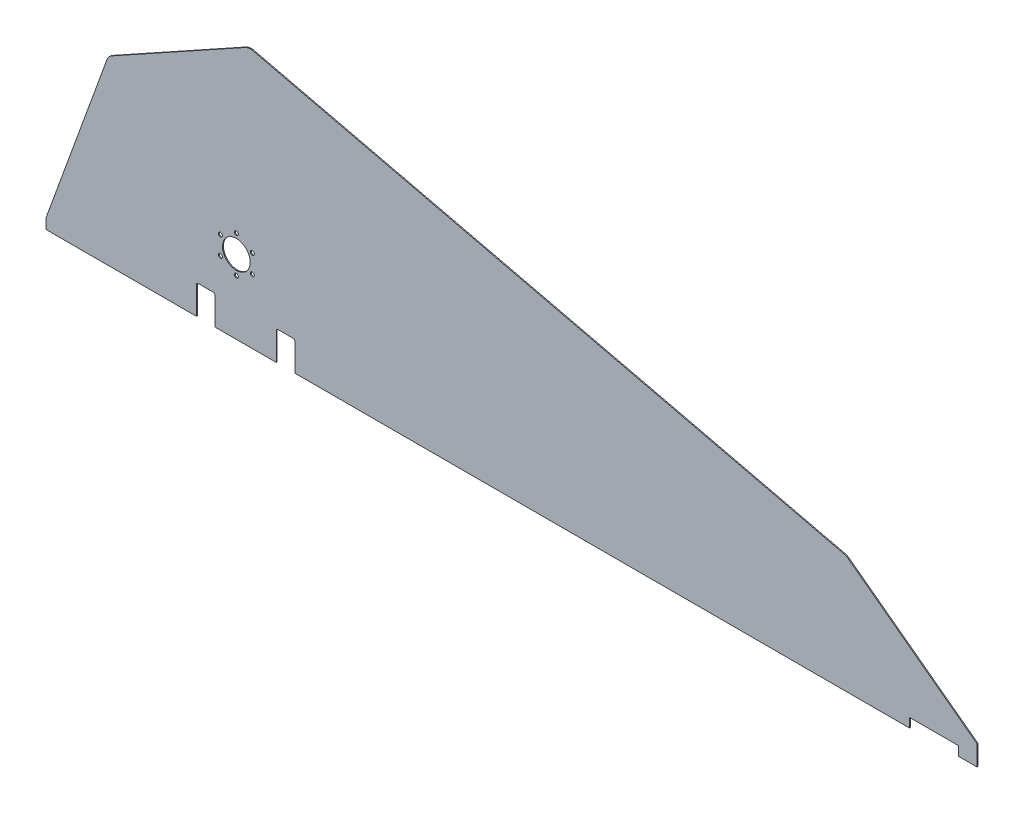
ISO-10303-21;
HEADER;
FILE_DESCRIPTION(('STEP AP214'),'2;1');
FILE_NAME('part.step','',(''),(''),'','','');
FILE_SCHEMA(('AUTOMOTIVE_DESIGN { 1 0 10303 214 1 1 1 1 }'));
ENDSEC;
DATA;
#1=APPLICATION_CONTEXT('core data for automotive mechanical design processes');
#2=APPLICATION_PROTOCOL_DEFINITION('international standard','automotive_design',2000,#1);
#3=PRODUCT_CONTEXT('',#1,'mechanical');
#4=PRODUCT('Part','Part','',(#3));
#5=PRODUCT_RELATED_PRODUCT_CATEGORY('part','',(#4));
#6=PRODUCT_DEFINITION_FORMATION('','',#4);
#7=PRODUCT_DEFINITION_CONTEXT('part definition',#1,'design');
#8=PRODUCT_DEFINITION('design','',#6,#7);
#9=PRODUCT_DEFINITION_SHAPE('','',#8);
#10=(LENGTH_UNIT() NAMED_UNIT(*) SI_UNIT(.MILLI.,.METRE.));
#11=(NAMED_UNIT(*) PLANE_ANGLE_UNIT() SI_UNIT($,.RADIAN.));
#12=(NAMED_UNIT(*) SI_UNIT($,.STERADIAN.) SOLID_ANGLE_UNIT());
#13=UNCERTAINTY_MEASURE_WITH_UNIT(LENGTH_MEASURE(1.E-05),#10,'distance_accuracy_value','');
#14=(GEOMETRIC_REPRESENTATION_CONTEXT(3) GLOBAL_UNCERTAINTY_ASSIGNED_CONTEXT((#13)) GLOBAL_UNIT_ASSIGNED_CONTEXT((#10,
#11,#12)) REPRESENTATION_CONTEXT('',''));
#15=CARTESIAN_POINT('',(0.,0.,0.));
#16=DIRECTION('',(0.,0.,1.));
#17=DIRECTION('',(1.,0.,0.));
#18=AXIS2_PLACEMENT_3D('',#15,#16,#17);
#19=CARTESIAN_POINT('',(-325.733197448333,28.2261893195208,1.5));
#20=DIRECTION('',(0.,0.,1.));
#21=DIRECTION('',(1.,0.,0.));
#22=AXIS2_PLACEMENT_3D('',#19,#20,#21);
#23=PLANE('',#22);
#24=CARTESIAN_POINT('',(-443.713959561865,88.2261893195209,1.5));
#25=DIRECTION('',(0.,0.,1.));
#26=DIRECTION('',(1.,0.,0.));
#27=AXIS2_PLACEMENT_3D('',#24,#25,#26);
#28=CIRCLE('',#27,3.24999999999998);
#29=CARTESIAN_POINT('',(-440.463959561865,88.2261893195209,1.5));
#30=VERTEX_POINT('',#29);
#31=EDGE_CURVE('E493',#30,#30,#28,.T.);
#32=ORIENTED_EDGE('',*,*,#31,.F.);
#33=EDGE_LOOP('',(#32));
#34=FACE_BOUND('',#33,.T.);
#35=CARTESIAN_POINT('',(-391.752435334798,88.2261893195219,1.5));
#36=DIRECTION('',(0.,0.,1.));
#37=DIRECTION('',(1.,0.,0.));
#38=AXIS2_PLACEMENT_3D('',#35,#36,#37);
#39=CIRCLE('',#38,3.24999999999991);
#40=CARTESIAN_POINT('',(-388.502435334798,88.2261893195219,1.5));
#41=VERTEX_POINT('',#40);
#42=EDGE_CURVE('E505',#41,#41,#39,.T.);
#43=ORIENTED_EDGE('',*,*,#42,.F.);
#44=EDGE_LOOP('',(#43));
#45=FACE_BOUND('',#44,.T.);
#46=CARTESIAN_POINT('',(-417.733197448333,103.226189319521,1.5));
#47=DIRECTION('',(0.,0.,1.));
#48=DIRECTION('',(1.,0.,0.));
#49=AXIS2_PLACEMENT_3D('',#46,#47,#48);
#50=CIRCLE('',#49,22.5000000000001);
#51=CARTESIAN_POINT('',(-395.233197448333,103.226189319521,1.5));
#52=VERTEX_POINT('',#51);
#53=EDGE_CURVE('E517',#52,#52,#50,.T.);
#54=ORIENTED_EDGE('',*,*,#53,.F.);
#55=EDGE_LOOP('',(#54));
#56=FACE_BOUND('',#55,.T.);
#57=DIRECTION('',(1.,0.,0.));
#58=VECTOR('',#57,1.);
#59=CARTESIAN_POINT('',(757.266802551668,-1.50000000000028,1.5));
#60=LINE('',#59,#58);
#61=CARTESIAN_POINT('',(677.266802551668,-1.50000000000028,1.5));
#62=VERTEX_POINT('',#61);
#63=CARTESIAN_POINT('',(757.266802551668,-1.50000000000028,1.5));
#64=VERTEX_POINT('',#63);
#65=EDGE_CURVE('E297',#62,#64,#60,.T.);
#66=ORIENTED_EDGE('',*,*,#65,.T.);
#67=DIRECTION('',(0.,-1.,0.));
#68=VECTOR('',#67,1.);
#69=CARTESIAN_POINT('',(757.266802551668,-16.5000000000003,1.5));
#70=LINE('',#69,#68);
#71=CARTESIAN_POINT('',(757.266802551668,-16.5000000000003,1.5));
#72=VERTEX_POINT('',#71);
#73=EDGE_CURVE('E150',#64,#72,#70,.T.);
#74=ORIENTED_EDGE('',*,*,#73,.T.);
#75=DIRECTION('',(1.,0.,0.));
#76=VECTOR('',#75,1.);
#77=CARTESIAN_POINT('',(787.266802551668,-16.5000000000001,1.5));
#78=LINE('',#77,#76);
#79=CARTESIAN_POINT('',(787.266802551668,-16.5000000000001,1.5));
#80=VERTEX_POINT('',#79);
#81=EDGE_CURVE('E366',#72,#80,#78,.T.);
#82=ORIENTED_EDGE('',*,*,#81,.T.);
#83=DIRECTION('',(0.,1.,0.));
#84=VECTOR('',#83,1.);
#85=CARTESIAN_POINT('',(787.266802551668,16.1155859339347,1.5));
#86=LINE('',#85,#84);
#87=CARTESIAN_POINT('',(787.266802551668,16.1155859339347,1.5));
#88=VERTEX_POINT('',#87);
#89=EDGE_CURVE('E384',#80,#88,#86,.T.);
#90=ORIENTED_EDGE('',*,*,#89,.T.);
#91=DIRECTION('',(-0.80191170374577,0.597442565771437,0.));
#92=VECTOR('',#91,1.);
#93=CARTESIAN_POINT('',(643.325554365466,123.355108982436,1.5));
#94=LINE('',#93,#92);
#95=CARTESIAN_POINT('',(577.338388413991,172.517057299047,1.5));
#96=VERTEX_POINT('',#95);
#97=EDGE_CURVE('E381',#88,#96,#94,.T.);
#98=ORIENTED_EDGE('',*,*,#97,.T.);
#99=CARTESIAN_POINT('',(567.038478580091,158.69209952647,1.5));
#100=DIRECTION('',(0.,0.,1.));
#101=DIRECTION('',(1.,0.,0.));
#102=AXIS2_PLACEMENT_3D('',#99,#100,#101);
#103=CIRCLE('',#102,17.2400000000004);
#104=CARTESIAN_POINT('',(571.017994955942,175.46651604134,1.5));
#105=VERTEX_POINT('',#104);
#106=EDGE_CURVE('E383',#96,#105,#103,.T.);
#107=ORIENTED_EDGE('',*,*,#106,.T.);
#108=DIRECTION('',(-0.972993997382236,0.230830416232648,0.));
#109=VECTOR('',#108,1.);
#110=CARTESIAN_POINT('',(-390.951446304286,403.681496942147,1.5));
#111=LINE('',#110,#109);
#112=CARTESIAN_POINT('',(-390.951446304286,403.681496942147,1.5));
#113=VERTEX_POINT('',#112);
#114=EDGE_CURVE('E386',#105,#113,#111,.T.);
#115=ORIENTED_EDGE('',*,*,#114,.T.);
#116=CARTESIAN_POINT('',(-394.930962680136,386.907080427276,1.5));
#117=DIRECTION('',(0.,0.,1.));
#118=DIRECTION('',(1.,0.,0.));
#119=AXIS2_PLACEMENT_3D('',#116,#117,#118);
#120=CIRCLE('',#119,17.2400000000002);
#121=CARTESIAN_POINT('',(-403.291964068148,401.983925448357,1.5));
#122=VERTEX_POINT('',#121);
#123=EDGE_CURVE('E392',#113,#122,#120,.T.);
#124=ORIENTED_EDGE('',*,*,#123,.T.);
#125=DIRECTION('',(-0.874526973380525,-0.48497687865495,0.));
#126=VECTOR('',#125,1.);
#127=CARTESIAN_POINT('',(-620.432527225473,281.566653305973,1.5));
#128=LINE('',#127,#126);
#129=CARTESIAN_POINT('',(-620.432527225473,281.566653305973,1.5));
#130=VERTEX_POINT('',#129);
#131=EDGE_CURVE('E394',#122,#130,#128,.T.);
#132=ORIENTED_EDGE('',*,*,#131,.T.);
#133=CARTESIAN_POINT('',(-612.071525837462,266.489808284892,1.5));
#134=DIRECTION('',(0.,0.,1.));
#135=DIRECTION('',(1.,0.,0.));
#136=AXIS2_PLACEMENT_3D('',#133,#134,#135);
#137=CIRCLE('',#136,17.2400000000002);
#138=CARTESIAN_POINT('',(-628.271826619812,272.386235555827,1.5));
#139=VERTEX_POINT('',#138);
#140=EDGE_CURVE('E396',#130,#139,#137,.T.);
#141=ORIENTED_EDGE('',*,*,#140,.T.);
#142=DIRECTION('',(-0.342020143325663,-0.93969262078591,0.));
#143=VECTOR('',#142,1.);
#144=CARTESIAN_POINT('',(-665.607683437264,169.806812013883,1.5));
#145=LINE('',#144,#143);
#146=CARTESIAN_POINT('',(-727.412308585953,0.,1.5));
#147=VERTEX_POINT('',#146);
#148=EDGE_CURVE('E398',#139,#147,#145,.T.);
#149=ORIENTED_EDGE('',*,*,#148,.T.);
#150=DIRECTION('',(0.,-1.,0.));
#151=VECTOR('',#150,1.);
#152=CARTESIAN_POINT('',(-727.412308585953,0.,1.5));
#153=LINE('',#152,#151);
#154=CARTESIAN_POINT('',(-727.412308585953,-16.5000000000001,1.5));
#155=VERTEX_POINT('',#154);
#156=EDGE_CURVE('E400',#147,#155,#153,.T.);
#157=ORIENTED_EDGE('',*,*,#156,.T.);
#158=DIRECTION('',(1.,0.,0.));
#159=VECTOR('',#158,1.);
#160=CARTESIAN_POINT('',(-727.412308585953,-16.5000000000001,1.5));
#161=LINE('',#160,#159);
#162=CARTESIAN_POINT('',(-482.733197448333,-16.5000000000001,1.5));
#163=VERTEX_POINT('',#162);
#164=EDGE_CURVE('E402',#155,#163,#161,.T.);
#165=ORIENTED_EDGE('',*,*,#164,.T.);
#166=DIRECTION('',(0.,1.,0.));
#167=VECTOR('',#166,1.);
#168=CARTESIAN_POINT('',(-482.733197448333,4.22618931952079,1.5));
#169=LINE('',#168,#167);
#170=CARTESIAN_POINT('',(-482.733197448333,28.2261893195208,1.5));
#171=VERTEX_POINT('',#170);
#172=EDGE_CURVE('E404',#163,#171,#169,.T.);
#173=ORIENTED_EDGE('',*,*,#172,.T.);
#174=CARTESIAN_POINT('',(-479.733197448332,28.2261893195208,1.5));
#175=DIRECTION('',(0.,0.,-1.));
#176=DIRECTION('',(1.,0.,0.));
#177=AXIS2_PLACEMENT_3D('',#174,#175,#176);
#178=CIRCLE('',#177,3.);
#179=CARTESIAN_POINT('',(-479.733197448332,31.2261893195208,1.5));
#180=VERTEX_POINT('',#179);
#181=EDGE_CURVE('E406',#171,#180,#178,.T.);
#182=ORIENTED_EDGE('',*,*,#181,.T.);
#183=DIRECTION('',(1.,0.,0.));
#184=VECTOR('',#183,1.);
#185=CARTESIAN_POINT('',(-455.733197448332,31.2261893195208,1.5));
#186=LINE('',#185,#184);
#187=CARTESIAN_POINT('',(-455.733197448332,31.2261893195208,1.5));
#188=VERTEX_POINT('',#187);
#189=EDGE_CURVE('E408',#180,#188,#186,.T.);
#190=ORIENTED_EDGE('',*,*,#189,.T.);
#191=CARTESIAN_POINT('',(-455.733197448332,28.2261893195208,1.5));
#192=DIRECTION('',(0.,0.,-1.));
#193=DIRECTION('',(1.,0.,0.));
#194=AXIS2_PLACEMENT_3D('',#191,#192,#193);
#195=CIRCLE('',#194,3.);
#196=CARTESIAN_POINT('',(-452.733197448332,28.2261893195208,1.5));
#197=VERTEX_POINT('',#196);
#198=EDGE_CURVE('E410',#188,#197,#195,.T.);
#199=ORIENTED_EDGE('',*,*,#198,.T.);
#200=DIRECTION('',(0.,-1.,0.));
#201=VECTOR('',#200,1.);
#202=CARTESIAN_POINT('',(-452.733197448332,4.22618931952079,1.5));
#203=LINE('',#202,#201);
#204=CARTESIAN_POINT('',(-452.733197448332,-16.5000000000001,1.5));
#205=VERTEX_POINT('',#204);
#206=EDGE_CURVE('E412',#197,#205,#203,.T.);
#207=ORIENTED_EDGE('',*,*,#206,.T.);
#208=DIRECTION('',(1.,0.,0.));
#209=VECTOR('',#208,1.);
#210=CARTESIAN_POINT('',(-452.733197448332,-16.5000000000001,1.5));
#211=LINE('',#210,#209);
#212=CARTESIAN_POINT('',(-352.733197448333,-16.5000000000001,1.5));
#213=VERTEX_POINT('',#212);
#214=EDGE_CURVE('E414',#205,#213,#211,.T.);
#215=ORIENTED_EDGE('',*,*,#214,.T.);
#216=DIRECTION('',(0.,1.,0.));
#217=VECTOR('',#216,1.);
#218=CARTESIAN_POINT('',(-352.733197448333,4.22618931952078,1.5));
#219=LINE('',#218,#217);
#220=CARTESIAN_POINT('',(-352.733197448333,28.2261893195208,1.5));
#221=VERTEX_POINT('',#220);
#222=EDGE_CURVE('E416',#213,#221,#219,.T.);
#223=ORIENTED_EDGE('',*,*,#222,.T.);
#224=CARTESIAN_POINT('',(-349.733197448333,28.2261893195208,1.5));
#225=DIRECTION('',(0.,0.,-1.));
#226=DIRECTION('',(1.,0.,0.));
#227=AXIS2_PLACEMENT_3D('',#224,#225,#226);
#228=CIRCLE('',#227,3.);
#229=CARTESIAN_POINT('',(-349.733197448333,31.2261893195208,1.5));
#230=VERTEX_POINT('',#229);
#231=EDGE_CURVE('E418',#221,#230,#228,.T.);
#232=ORIENTED_EDGE('',*,*,#231,.T.);
#233=DIRECTION('',(1.,0.,0.));
#234=VECTOR('',#233,1.);
#235=CARTESIAN_POINT('',(-325.733197448333,31.2261893195208,1.5));
#236=LINE('',#235,#234);
#237=CARTESIAN_POINT('',(-325.733197448333,31.2261893195208,1.5));
#238=VERTEX_POINT('',#237);
#239=EDGE_CURVE('E420',#230,#238,#236,.T.);
#240=ORIENTED_EDGE('',*,*,#239,.T.);
#241=CARTESIAN_POINT('',(-325.733197448333,28.2261893195208,1.5));
#242=DIRECTION('',(0.,0.,-1.));
#243=DIRECTION('',(1.,0.,0.));
#244=AXIS2_PLACEMENT_3D('',#241,#242,#243);
#245=CIRCLE('',#244,3.);
#246=CARTESIAN_POINT('',(-322.733197448332,28.2261893195208,1.5));
#247=VERTEX_POINT('',#246);
#248=EDGE_CURVE('E223',#238,#247,#245,.T.);
#249=ORIENTED_EDGE('',*,*,#248,.T.);
#250=DIRECTION('',(0.,-1.,0.));
#251=VECTOR('',#250,1.);
#252=CARTESIAN_POINT('',(-322.733197448332,4.22618931952076,1.5));
#253=LINE('',#252,#251);
#254=CARTESIAN_POINT('',(-322.733197448332,-16.5000000000001,1.5));
#255=VERTEX_POINT('',#254);
#256=EDGE_CURVE('E217',#247,#255,#253,.T.);
#257=ORIENTED_EDGE('',*,*,#256,.T.);
#258=DIRECTION('',(1.,0.,0.));
#259=VECTOR('',#258,1.);
#260=CARTESIAN_POINT('',(-322.733197448332,-16.5000000000001,1.5));
#261=LINE('',#260,#259);
#262=CARTESIAN_POINT('',(677.266802551668,-16.5000000000003,1.5));
#263=VERTEX_POINT('',#262);
#264=EDGE_CURVE('E221',#255,#263,#261,.T.);
#265=ORIENTED_EDGE('',*,*,#264,.T.);
#266=DIRECTION('',(0.,1.,0.));
#267=VECTOR('',#266,1.);
#268=CARTESIAN_POINT('',(677.266802551668,-1.50000000000028,1.5));
#269=LINE('',#268,#267);
#270=EDGE_CURVE('E53',#263,#62,#269,.T.);
#271=ORIENTED_EDGE('',*,*,#270,.T.);
#272=EDGE_LOOP('',(#66,#74,#82,#90,#98,#107,#115,#124,#132,#141,#149,#157,#165,#173,#182,#190,
#199,#207,#215,#223,#232,#240,#249,#257,#265,#271));
#273=FACE_BOUND('',#272,.T.);
#274=CARTESIAN_POINT('',(-417.733197448333,133.226189319521,1.5));
#275=DIRECTION('',(0.,0.,1.));
#276=DIRECTION('',(1.,0.,0.));
#277=AXIS2_PLACEMENT_3D('',#274,#275,#276);
#278=CIRCLE('',#277,3.24999999999995);
#279=CARTESIAN_POINT('',(-414.483197448333,133.226189319521,1.5));
#280=VERTEX_POINT('',#279);
#281=EDGE_CURVE('E244',#280,#280,#278,.T.);
#282=ORIENTED_EDGE('',*,*,#281,.F.);
#283=EDGE_LOOP('',(#282));
#284=FACE_BOUND('',#283,.T.);
#285=CARTESIAN_POINT('',(-391.752435334799,118.226189319522,1.5));
#286=DIRECTION('',(0.,0.,1.));
#287=DIRECTION('',(1.,0.,0.));
#288=AXIS2_PLACEMENT_3D('',#285,#286,#287);
#289=CIRCLE('',#288,3.2499999999999);
#290=CARTESIAN_POINT('',(-388.502435334799,118.226189319522,1.5));
#291=VERTEX_POINT('',#290);
#292=EDGE_CURVE('E511',#291,#291,#289,.T.);
#293=ORIENTED_EDGE('',*,*,#292,.F.);
#294=EDGE_LOOP('',(#293));
#295=FACE_BOUND('',#294,.T.);
#296=CARTESIAN_POINT('',(-417.733197448331,73.2261893195213,1.5));
#297=DIRECTION('',(0.,0.,1.));
#298=DIRECTION('',(1.,0.,0.));
#299=AXIS2_PLACEMENT_3D('',#296,#297,#298);
#300=CIRCLE('',#299,3.24999999999995);
#301=CARTESIAN_POINT('',(-414.483197448331,73.2261893195213,1.5));
#302=VERTEX_POINT('',#301);
#303=EDGE_CURVE('E499',#302,#302,#300,.T.);
#304=ORIENTED_EDGE('',*,*,#303,.F.);
#305=EDGE_LOOP('',(#304));
#306=FACE_BOUND('',#305,.T.);
#307=CARTESIAN_POINT('',(-443.713959561865,118.226189319521,1.5));
#308=DIRECTION('',(0.,0.,1.));
#309=DIRECTION('',(1.,0.,0.));
#310=AXIS2_PLACEMENT_3D('',#307,#308,#309);
#311=CIRCLE('',#310,3.25000000000002);
#312=CARTESIAN_POINT('',(-440.463959561865,118.226189319521,1.5));
#313=VERTEX_POINT('',#312);
#314=EDGE_CURVE('E484',#313,#313,#311,.T.);
#315=ORIENTED_EDGE('',*,*,#314,.F.);
#316=EDGE_LOOP('',(#315));
#317=FACE_BOUND('',#316,.T.);
#318=ADVANCED_FACE('F36',(#34,#45,#56,#273,#284,#295,#306,#317),#23,.T.);
#319=CARTESIAN_POINT('',(-325.733197448333,28.2261893195208,0.));
#320=DIRECTION('',(0.,0.,1.));
#321=DIRECTION('',(1.,0.,0.));
#322=AXIS2_PLACEMENT_3D('',#319,#320,#321);
#323=PLANE('',#322);
#324=DIRECTION('',(1.,0.,0.));
#325=VECTOR('',#324,1.);
#326=CARTESIAN_POINT('',(757.266802551668,-1.50000000000028,0.));
#327=LINE('',#326,#325);
#328=CARTESIAN_POINT('',(677.266802551668,-1.50000000000028,0.));
#329=VERTEX_POINT('',#328);
#330=CARTESIAN_POINT('',(757.266802551668,-1.50000000000028,0.));
#331=VERTEX_POINT('',#330);
#332=EDGE_CURVE('E240',#329,#331,#327,.T.);
#333=ORIENTED_EDGE('',*,*,#332,.F.);
#334=DIRECTION('',(0.,1.,0.));
#335=VECTOR('',#334,1.);
#336=CARTESIAN_POINT('',(677.266802551668,-1.50000000000028,0.));
#337=LINE('',#336,#335);
#338=CARTESIAN_POINT('',(677.266802551668,-16.5000000000003,0.));
#339=VERTEX_POINT('',#338);
#340=EDGE_CURVE('E142',#339,#329,#337,.T.);
#341=ORIENTED_EDGE('',*,*,#340,.F.);
#342=DIRECTION('',(1.,0.,0.));
#343=VECTOR('',#342,1.);
#344=CARTESIAN_POINT('',(-322.733197448332,-16.5000000000001,0.));
#345=LINE('',#344,#343);
#346=CARTESIAN_POINT('',(-322.733197448332,-16.5000000000001,0.));
#347=VERTEX_POINT('',#346);
#348=EDGE_CURVE('E136',#347,#339,#345,.T.);
#349=ORIENTED_EDGE('',*,*,#348,.F.);
#350=DIRECTION('',(0.,-1.,0.));
#351=VECTOR('',#350,1.);
#352=CARTESIAN_POINT('',(-322.733197448332,-16.5000000000001,0.));
#353=LINE('',#352,#351);
#354=CARTESIAN_POINT('',(-322.733197448332,28.2261893195208,0.));
#355=VERTEX_POINT('',#354);
#356=EDGE_CURVE('E230',#355,#347,#353,.T.);
#357=ORIENTED_EDGE('',*,*,#356,.F.);
#358=CARTESIAN_POINT('',(-325.733197448333,28.2261893195208,0.));
#359=DIRECTION('',(0.,0.,-1.));
#360=DIRECTION('',(1.,0.,0.));
#361=AXIS2_PLACEMENT_3D('',#358,#359,#360);
#362=CIRCLE('',#361,3.);
#363=CARTESIAN_POINT('',(-325.733197448333,31.2261893195208,0.));
#364=VERTEX_POINT('',#363);
#365=EDGE_CURVE('E291',#364,#355,#362,.T.);
#366=ORIENTED_EDGE('',*,*,#365,.F.);
#367=DIRECTION('',(1.,0.,0.));
#368=VECTOR('',#367,1.);
#369=CARTESIAN_POINT('',(-325.733197448333,31.2261893195208,0.));
#370=LINE('',#369,#368);
#371=CARTESIAN_POINT('',(-349.733197448333,31.2261893195208,0.));
#372=VERTEX_POINT('',#371);
#373=EDGE_CURVE('E289',#372,#364,#370,.T.);
#374=ORIENTED_EDGE('',*,*,#373,.F.);
#375=CARTESIAN_POINT('',(-349.733197448333,28.2261893195208,0.));
#376=DIRECTION('',(0.,0.,-1.));
#377=DIRECTION('',(1.,0.,0.));
#378=AXIS2_PLACEMENT_3D('',#375,#376,#377);
#379=CIRCLE('',#378,3.);
#380=CARTESIAN_POINT('',(-352.733197448333,28.2261893195208,0.));
#381=VERTEX_POINT('',#380);
#382=EDGE_CURVE('E287',#381,#372,#379,.T.);
#383=ORIENTED_EDGE('',*,*,#382,.F.);
#384=DIRECTION('',(0.,1.,0.));
#385=VECTOR('',#384,1.);
#386=CARTESIAN_POINT('',(-352.733197448333,28.2261893195208,0.));
#387=LINE('',#386,#385);
#388=CARTESIAN_POINT('',(-352.733197448333,-16.5000000000001,0.));
#389=VERTEX_POINT('',#388);
#390=EDGE_CURVE('E285',#389,#381,#387,.T.);
#391=ORIENTED_EDGE('',*,*,#390,.F.);
#392=DIRECTION('',(1.,0.,0.));
#393=VECTOR('',#392,1.);
#394=CARTESIAN_POINT('',(-452.733197448332,-16.5000000000001,0.));
#395=LINE('',#394,#393);
#396=CARTESIAN_POINT('',(-452.733197448332,-16.5000000000001,0.));
#397=VERTEX_POINT('',#396);
#398=EDGE_CURVE('E282',#397,#389,#395,.T.);
#399=ORIENTED_EDGE('',*,*,#398,.F.);
#400=DIRECTION('',(0.,-1.,0.));
#401=VECTOR('',#400,1.);
#402=CARTESIAN_POINT('',(-452.733197448332,-16.5000000000001,0.));
#403=LINE('',#402,#401);
#404=CARTESIAN_POINT('',(-452.733197448332,28.2261893195208,0.));
#405=VERTEX_POINT('',#404);
#406=EDGE_CURVE('E280',#405,#397,#403,.T.);
#407=ORIENTED_EDGE('',*,*,#406,.F.);
#408=CARTESIAN_POINT('',(-455.733197448332,28.2261893195208,0.));
#409=DIRECTION('',(0.,0.,-1.));
#410=DIRECTION('',(1.,0.,0.));
#411=AXIS2_PLACEMENT_3D('',#408,#409,#410);
#412=CIRCLE('',#411,3.);
#413=CARTESIAN_POINT('',(-455.733197448332,31.2261893195208,0.));
#414=VERTEX_POINT('',#413);
#415=EDGE_CURVE('E277',#414,#405,#412,.T.);
#416=ORIENTED_EDGE('',*,*,#415,.F.);
#417=DIRECTION('',(1.,0.,0.));
#418=VECTOR('',#417,1.);
#419=CARTESIAN_POINT('',(-455.733197448332,31.2261893195208,0.));
#420=LINE('',#419,#418);
#421=CARTESIAN_POINT('',(-479.733197448332,31.2261893195208,0.));
#422=VERTEX_POINT('',#421);
#423=EDGE_CURVE('E275',#422,#414,#420,.T.);
#424=ORIENTED_EDGE('',*,*,#423,.F.);
#425=CARTESIAN_POINT('',(-479.733197448332,28.2261893195208,0.));
#426=DIRECTION('',(0.,0.,-1.));
#427=DIRECTION('',(1.,0.,0.));
#428=AXIS2_PLACEMENT_3D('',#425,#426,#427);
#429=CIRCLE('',#428,3.);
#430=CARTESIAN_POINT('',(-482.733197448333,28.2261893195208,0.));
#431=VERTEX_POINT('',#430);
#432=EDGE_CURVE('E273',#431,#422,#429,.T.);
#433=ORIENTED_EDGE('',*,*,#432,.F.);
#434=DIRECTION('',(0.,1.,0.));
#435=VECTOR('',#434,1.);
#436=CARTESIAN_POINT('',(-482.733197448333,28.2261893195208,0.));
#437=LINE('',#436,#435);
#438=CARTESIAN_POINT('',(-482.733197448333,-16.5000000000001,0.));
#439=VERTEX_POINT('',#438);
#440=EDGE_CURVE('E271',#439,#431,#437,.T.);
#441=ORIENTED_EDGE('',*,*,#440,.F.);
#442=DIRECTION('',(1.,0.,0.));
#443=VECTOR('',#442,1.);
#444=CARTESIAN_POINT('',(-727.412308585953,-16.5000000000001,0.));
#445=LINE('',#444,#443);
#446=CARTESIAN_POINT('',(-727.412308585953,-16.5000000000001,0.));
#447=VERTEX_POINT('',#446);
#448=EDGE_CURVE('E268',#447,#439,#445,.T.);
#449=ORIENTED_EDGE('',*,*,#448,.F.);
#450=DIRECTION('',(0.,-1.,0.));
#451=VECTOR('',#450,1.);
#452=CARTESIAN_POINT('',(-727.412308585953,0.,0.));
#453=LINE('',#452,#451);
#454=CARTESIAN_POINT('',(-727.412308585953,0.,0.));
#455=VERTEX_POINT('',#454);
#456=EDGE_CURVE('E266',#455,#447,#453,.T.);
#457=ORIENTED_EDGE('',*,*,#456,.F.);
#458=DIRECTION('',(-0.342020143325663,-0.93969262078591,0.));
#459=VECTOR('',#458,1.);
#460=CARTESIAN_POINT('',(-665.607683437264,169.806812013883,0.));
#461=LINE('',#460,#459);
#462=CARTESIAN_POINT('',(-628.271826619812,272.386235555827,0.));
#463=VERTEX_POINT('',#462);
#464=EDGE_CURVE('E264',#463,#455,#461,.T.);
#465=ORIENTED_EDGE('',*,*,#464,.F.);
#466=CARTESIAN_POINT('',(-612.071525837462,266.489808284892,0.));
#467=DIRECTION('',(0.,0.,1.));
#468=DIRECTION('',(1.,0.,0.));
#469=AXIS2_PLACEMENT_3D('',#466,#467,#468);
#470=CIRCLE('',#469,17.2400000000002);
#471=CARTESIAN_POINT('',(-620.432527225473,281.566653305973,0.));
#472=VERTEX_POINT('',#471);
#473=EDGE_CURVE('E261',#472,#463,#470,.T.);
#474=ORIENTED_EDGE('',*,*,#473,.F.);
#475=DIRECTION('',(-0.874526973380525,-0.48497687865495,0.));
#476=VECTOR('',#475,1.);
#477=CARTESIAN_POINT('',(-620.432527225473,281.566653305973,0.));
#478=LINE('',#477,#476);
#479=CARTESIAN_POINT('',(-403.291964068148,401.983925448357,0.));
#480=VERTEX_POINT('',#479);
#481=EDGE_CURVE('E259',#480,#472,#478,.T.);
#482=ORIENTED_EDGE('',*,*,#481,.F.);
#483=CARTESIAN_POINT('',(-394.930962680136,386.907080427276,0.));
#484=DIRECTION('',(0.,0.,1.));
#485=DIRECTION('',(1.,0.,0.));
#486=AXIS2_PLACEMENT_3D('',#483,#484,#485);
#487=CIRCLE('',#486,17.2400000000002);
#488=CARTESIAN_POINT('',(-390.951446304286,403.681496942147,0.));
#489=VERTEX_POINT('',#488);
#490=EDGE_CURVE('E257',#489,#480,#487,.T.);
#491=ORIENTED_EDGE('',*,*,#490,.F.);
#492=DIRECTION('',(-0.972993997382236,0.230830416232648,0.));
#493=VECTOR('',#492,1.);
#494=CARTESIAN_POINT('',(-390.951446304286,403.681496942147,0.));
#495=LINE('',#494,#493);
#496=CARTESIAN_POINT('',(571.017994955942,175.46651604134,0.));
#497=VERTEX_POINT('',#496);
#498=EDGE_CURVE('E255',#497,#489,#495,.T.);
#499=ORIENTED_EDGE('',*,*,#498,.F.);
#500=CARTESIAN_POINT('',(567.038478580091,158.69209952647,0.));
#501=DIRECTION('',(0.,0.,1.));
#502=DIRECTION('',(1.,0.,0.));
#503=AXIS2_PLACEMENT_3D('',#500,#501,#502);
#504=CIRCLE('',#503,17.2400000000004);
#505=CARTESIAN_POINT('',(577.338388413991,172.517057299047,0.));
#506=VERTEX_POINT('',#505);
#507=EDGE_CURVE('E253',#506,#497,#504,.T.);
#508=ORIENTED_EDGE('',*,*,#507,.F.);
#509=DIRECTION('',(-0.80191170374577,0.597442565771436,0.));
#510=VECTOR('',#509,1.);
#511=CARTESIAN_POINT('',(577.338388413991,172.517057299047,0.));
#512=LINE('',#511,#510);
#513=CARTESIAN_POINT('',(787.266802551668,16.1155859339347,0.));
#514=VERTEX_POINT('',#513);
#515=EDGE_CURVE('E251',#514,#506,#512,.T.);
#516=ORIENTED_EDGE('',*,*,#515,.F.);
#517=DIRECTION('',(0.,1.,0.));
#518=VECTOR('',#517,1.);
#519=CARTESIAN_POINT('',(787.266802551668,16.1155859339347,0.));
#520=LINE('',#519,#518);
#521=CARTESIAN_POINT('',(787.266802551668,-16.5000000000001,0.));
#522=VERTEX_POINT('',#521);
#523=EDGE_CURVE('E248',#522,#514,#520,.T.);
#524=ORIENTED_EDGE('',*,*,#523,.F.);
#525=DIRECTION('',(1.,0.,0.));
#526=VECTOR('',#525,1.);
#527=CARTESIAN_POINT('',(787.266802551668,-16.5000000000001,0.));
#528=LINE('',#527,#526);
#529=CARTESIAN_POINT('',(757.266802551668,-16.5000000000003,0.));
#530=VERTEX_POINT('',#529);
#531=EDGE_CURVE('E246',#530,#522,#528,.T.);
#532=ORIENTED_EDGE('',*,*,#531,.F.);
#533=DIRECTION('',(0.,-1.,0.));
#534=VECTOR('',#533,1.);
#535=CARTESIAN_POINT('',(757.266802551668,-16.5000000000003,0.));
#536=LINE('',#535,#534);
#537=EDGE_CURVE('E243',#331,#530,#536,.T.);
#538=ORIENTED_EDGE('',*,*,#537,.F.);
#539=EDGE_LOOP('',(#333,#341,#349,#357,#366,#374,#383,#391,#399,#407,#416,#424,#433,#441,#449,
#457,#465,#474,#482,#491,#499,#508,#516,#524,#532,#538));
#540=FACE_BOUND('',#539,.T.);
#541=CARTESIAN_POINT('',(-417.733197448333,133.226189319521,0.));
#542=DIRECTION('',(0.,0.,1.));
#543=DIRECTION('',(1.,0.,0.));
#544=AXIS2_PLACEMENT_3D('',#541,#542,#543);
#545=CIRCLE('',#544,3.24999999999995);
#546=CARTESIAN_POINT('',(-414.483197448333,133.226189319521,0.));
#547=VERTEX_POINT('',#546);
#548=EDGE_CURVE('E520',#547,#547,#545,.T.);
#549=ORIENTED_EDGE('',*,*,#548,.T.);
#550=EDGE_LOOP('',(#549));
#551=FACE_BOUND('',#550,.T.);
#552=CARTESIAN_POINT('',(-417.733197448333,103.226189319521,0.));
#553=DIRECTION('',(0.,0.,1.));
#554=DIRECTION('',(1.,0.,0.));
#555=AXIS2_PLACEMENT_3D('',#552,#553,#554);
#556=CIRCLE('',#555,22.5000000000001);
#557=CARTESIAN_POINT('',(-395.233197448333,103.226189319521,0.));
#558=VERTEX_POINT('',#557);
#559=EDGE_CURVE('E514',#558,#558,#556,.T.);
#560=ORIENTED_EDGE('',*,*,#559,.T.);
#561=EDGE_LOOP('',(#560));
#562=FACE_BOUND('',#561,.T.);
#563=CARTESIAN_POINT('',(-391.752435334799,118.226189319522,0.));
#564=DIRECTION('',(0.,0.,1.));
#565=DIRECTION('',(1.,0.,0.));
#566=AXIS2_PLACEMENT_3D('',#563,#564,#565);
#567=CIRCLE('',#566,3.2499999999999);
#568=CARTESIAN_POINT('',(-388.502435334799,118.226189319522,0.));
#569=VERTEX_POINT('',#568);
#570=EDGE_CURVE('E508',#569,#569,#567,.T.);
#571=ORIENTED_EDGE('',*,*,#570,.T.);
#572=EDGE_LOOP('',(#571));
#573=FACE_BOUND('',#572,.T.);
#574=CARTESIAN_POINT('',(-391.752435334798,88.2261893195219,0.));
#575=DIRECTION('',(0.,0.,1.));
#576=DIRECTION('',(1.,0.,0.));
#577=AXIS2_PLACEMENT_3D('',#574,#575,#576);
#578=CIRCLE('',#577,3.24999999999991);
#579=CARTESIAN_POINT('',(-388.502435334798,88.2261893195219,0.));
#580=VERTEX_POINT('',#579);
#581=EDGE_CURVE('E502',#580,#580,#578,.T.);
#582=ORIENTED_EDGE('',*,*,#581,.T.);
#583=EDGE_LOOP('',(#582));
#584=FACE_BOUND('',#583,.T.);
#585=CARTESIAN_POINT('',(-417.733197448331,73.2261893195213,0.));
#586=DIRECTION('',(0.,0.,1.));
#587=DIRECTION('',(1.,0.,0.));
#588=AXIS2_PLACEMENT_3D('',#585,#586,#587);
#589=CIRCLE('',#588,3.24999999999995);
#590=CARTESIAN_POINT('',(-414.483197448331,73.2261893195213,0.));
#591=VERTEX_POINT('',#590);
#592=EDGE_CURVE('E496',#591,#591,#589,.T.);
#593=ORIENTED_EDGE('',*,*,#592,.T.);
#594=EDGE_LOOP('',(#593));
#595=FACE_BOUND('',#594,.T.);
#596=CARTESIAN_POINT('',(-443.713959561865,88.2261893195209,0.));
#597=DIRECTION('',(0.,0.,1.));
#598=DIRECTION('',(1.,0.,0.));
#599=AXIS2_PLACEMENT_3D('',#596,#597,#598);
#600=CIRCLE('',#599,3.24999999999998);
#601=CARTESIAN_POINT('',(-440.463959561865,88.2261893195209,0.));
#602=VERTEX_POINT('',#601);
#603=EDGE_CURVE('E490',#602,#602,#600,.T.);
#604=ORIENTED_EDGE('',*,*,#603,.T.);
#605=EDGE_LOOP('',(#604));
#606=FACE_BOUND('',#605,.T.);
#607=CARTESIAN_POINT('',(-443.713959561865,118.226189319521,0.));
#608=DIRECTION('',(0.,0.,1.));
#609=DIRECTION('',(1.,0.,0.));
#610=AXIS2_PLACEMENT_3D('',#607,#608,#609);
#611=CIRCLE('',#610,3.25000000000002);
#612=CARTESIAN_POINT('',(-440.463959561865,118.226189319521,0.));
#613=VERTEX_POINT('',#612);
#614=EDGE_CURVE('E487',#613,#613,#611,.T.);
#615=ORIENTED_EDGE('',*,*,#614,.T.);
#616=EDGE_LOOP('',(#615));
#617=FACE_BOUND('',#616,.T.);
#618=ADVANCED_FACE('F370',(#540,#551,#562,#573,#584,#595,#606,#617),#323,.F.);
#619=CARTESIAN_POINT('',(757.266802551668,-1.50000000000028,1.5));
#620=DIRECTION('',(0.,1.,0.));
#621=DIRECTION('',(0.,0.,1.));
#622=AXIS2_PLACEMENT_3D('',#619,#620,#621);
#623=PLANE('',#622);
#624=ORIENTED_EDGE('',*,*,#332,.T.);
#625=DIRECTION('',(0.,0.,-1.));
#626=VECTOR('',#625,1.);
#627=CARTESIAN_POINT('',(757.266802551668,-1.50000000000028,1.5));
#628=LINE('',#627,#626);
#629=EDGE_CURVE('E11',#64,#331,#628,.T.);
#630=ORIENTED_EDGE('',*,*,#629,.F.);
#631=ORIENTED_EDGE('',*,*,#65,.F.);
#632=DIRECTION('',(0.,0.,-1.));
#633=VECTOR('',#632,1.);
#634=CARTESIAN_POINT('',(677.266802551668,-1.50000000000028,1.5));
#635=LINE('',#634,#633);
#636=EDGE_CURVE('E236',#62,#329,#635,.T.);
#637=ORIENTED_EDGE('',*,*,#636,.T.);
#638=EDGE_LOOP('',(#624,#630,#631,#637));
#639=FACE_BOUND('',#638,.T.);
#640=ADVANCED_FACE('F38',(#639),#623,.F.);
#641=CARTESIAN_POINT('',(757.266802551668,-16.5000000000003,1.5));
#642=DIRECTION('',(1.,0.,0.));
#643=DIRECTION('',(0.,0.,-1.));
#644=AXIS2_PLACEMENT_3D('',#641,#642,#643);
#645=PLANE('',#644);
#646=ORIENTED_EDGE('',*,*,#537,.T.);
#647=DIRECTION('',(0.,0.,-1.));
#648=VECTOR('',#647,1.);
#649=CARTESIAN_POINT('',(757.266802551668,-16.5000000000003,1.5));
#650=LINE('',#649,#648);
#651=EDGE_CURVE('E45',#72,#530,#650,.T.);
#652=ORIENTED_EDGE('',*,*,#651,.F.);
#653=ORIENTED_EDGE('',*,*,#73,.F.);
#654=ORIENTED_EDGE('',*,*,#629,.T.);
#655=EDGE_LOOP('',(#646,#652,#653,#654));
#656=FACE_BOUND('',#655,.T.);
#657=ADVANCED_FACE('F821',(#656),#645,.F.);
#658=CARTESIAN_POINT('',(787.266802551668,-16.5000000000001,1.5));
#659=DIRECTION('',(0.,1.,0.));
#660=DIRECTION('',(-1.,0.,0.));
#661=AXIS2_PLACEMENT_3D('',#658,#659,#660);
#662=PLANE('',#661);
#663=ORIENTED_EDGE('',*,*,#531,.T.);
#664=DIRECTION('',(0.,0.,-1.));
#665=VECTOR('',#664,1.);
#666=CARTESIAN_POINT('',(787.266802551668,-16.5000000000001,1.5));
#667=LINE('',#666,#665);
#668=EDGE_CURVE('E358',#80,#522,#667,.T.);
#669=ORIENTED_EDGE('',*,*,#668,.F.);
#670=ORIENTED_EDGE('',*,*,#81,.F.);
#671=ORIENTED_EDGE('',*,*,#651,.T.);
#672=EDGE_LOOP('',(#663,#669,#670,#671));
#673=FACE_BOUND('',#672,.T.);
#674=ADVANCED_FACE('F364',(#673),#662,.F.);
#675=CARTESIAN_POINT('',(787.266802551668,16.1155859339347,1.5));
#676=DIRECTION('',(-1.,0.,0.));
#677=DIRECTION('',(0.,0.,1.));
#678=AXIS2_PLACEMENT_3D('',#675,#676,#677);
#679=PLANE('',#678);
#680=ORIENTED_EDGE('',*,*,#523,.T.);
#681=DIRECTION('',(0.,0.,-1.));
#682=VECTOR('',#681,1.);
#683=CARTESIAN_POINT('',(787.266802551668,16.1155859339347,1.5));
#684=LINE('',#683,#682);
#685=EDGE_CURVE('E355',#88,#514,#684,.T.);
#686=ORIENTED_EDGE('',*,*,#685,.F.);
#687=ORIENTED_EDGE('',*,*,#89,.F.);
#688=ORIENTED_EDGE('',*,*,#668,.T.);
#689=EDGE_LOOP('',(#680,#686,#687,#688));
#690=FACE_BOUND('',#689,.T.);
#691=ADVANCED_FACE('F375',(#690),#679,.F.);
#692=CARTESIAN_POINT('',(577.338388413991,172.517057299047,1.5));
#693=DIRECTION('',(-0.597442565771436,-0.80191170374577,0.));
#694=DIRECTION('',(0.80191170374577,-0.597442565771436,0.));
#695=AXIS2_PLACEMENT_3D('',#692,#693,#694);
#696=PLANE('',#695);
#697=ORIENTED_EDGE('',*,*,#515,.T.);
#698=DIRECTION('',(0.,0.,-1.));
#699=VECTOR('',#698,1.);
#700=CARTESIAN_POINT('',(577.338388413991,172.517057299047,1.5));
#701=LINE('',#700,#699);
#702=EDGE_CURVE('E352',#96,#506,#701,.T.);
#703=ORIENTED_EDGE('',*,*,#702,.F.);
#704=ORIENTED_EDGE('',*,*,#97,.F.);
#705=ORIENTED_EDGE('',*,*,#685,.T.);
#706=EDGE_LOOP('',(#697,#703,#704,#705));
#707=FACE_BOUND('',#706,.T.);
#708=ADVANCED_FACE('F379',(#707),#696,.F.);
#709=CARTESIAN_POINT('',(567.038478580091,158.69209952647,1.5));
#710=DIRECTION('',(0.,0.,-1.));
#711=DIRECTION('',(-1.,0.,0.));
#712=AXIS2_PLACEMENT_3D('',#709,#710,#711);
#713=CYLINDRICAL_SURFACE('',#712,17.2400000000004);
#714=ORIENTED_EDGE('',*,*,#507,.T.);
#715=DIRECTION('',(0.,0.,-1.));
#716=VECTOR('',#715,1.);
#717=CARTESIAN_POINT('',(571.017994955942,175.46651604134,1.5));
#718=LINE('',#717,#716);
#719=EDGE_CURVE('E349',#105,#497,#718,.T.);
#720=ORIENTED_EDGE('',*,*,#719,.F.);
#721=ORIENTED_EDGE('',*,*,#106,.F.);
#722=ORIENTED_EDGE('',*,*,#702,.T.);
#723=EDGE_LOOP('',(#714,#720,#721,#722));
#724=FACE_BOUND('',#723,.T.);
#725=ADVANCED_FACE('F782',(#724),#713,.T.);
#726=CARTESIAN_POINT('',(-390.951446304286,403.681496942147,1.5));
#727=DIRECTION('',(-0.230830416232648,-0.972993997382236,0.));
#728=DIRECTION('',(0.972993997382236,-0.230830416232648,0.));
#729=AXIS2_PLACEMENT_3D('',#726,#727,#728);
#730=PLANE('',#729);
#731=ORIENTED_EDGE('',*,*,#498,.T.);
#732=DIRECTION('',(0.,0.,-1.));
#733=VECTOR('',#732,1.);
#734=CARTESIAN_POINT('',(-390.951446304286,403.681496942147,1.5));
#735=LINE('',#734,#733);
#736=EDGE_CURVE('E346',#113,#489,#735,.T.);
#737=ORIENTED_EDGE('',*,*,#736,.F.);
#738=ORIENTED_EDGE('',*,*,#114,.F.);
#739=ORIENTED_EDGE('',*,*,#719,.T.);
#740=EDGE_LOOP('',(#731,#737,#738,#739));
#741=FACE_BOUND('',#740,.T.);
#742=ADVANCED_FACE('F771',(#741),#730,.F.);
#743=CARTESIAN_POINT('',(-394.930962680136,386.907080427276,1.5));
#744=DIRECTION('',(0.,0.,-1.));
#745=DIRECTION('',(-1.,0.,0.));
#746=AXIS2_PLACEMENT_3D('',#743,#744,#745);
#747=CYLINDRICAL_SURFACE('',#746,17.2400000000002);
#748=ORIENTED_EDGE('',*,*,#490,.T.);
#749=DIRECTION('',(0.,0.,-1.));
#750=VECTOR('',#749,1.);
#751=CARTESIAN_POINT('',(-403.291964068148,401.983925448357,1.5));
#752=LINE('',#751,#750);
#753=EDGE_CURVE('E343',#122,#480,#752,.T.);
#754=ORIENTED_EDGE('',*,*,#753,.F.);
#755=ORIENTED_EDGE('',*,*,#123,.F.);
#756=ORIENTED_EDGE('',*,*,#736,.T.);
#757=EDGE_LOOP('',(#748,#754,#755,#756));
#758=FACE_BOUND('',#757,.T.);
#759=ADVANCED_FACE('F760',(#758),#747,.T.);
#760=CARTESIAN_POINT('',(-620.432527225473,281.566653305973,1.5));
#761=DIRECTION('',(0.48497687865495,-0.874526973380525,0.));
#762=DIRECTION('',(0.874526973380525,0.48497687865495,0.));
#763=AXIS2_PLACEMENT_3D('',#760,#761,#762);
#764=PLANE('',#763);
#765=ORIENTED_EDGE('',*,*,#481,.T.);
#766=DIRECTION('',(0.,0.,-1.));
#767=VECTOR('',#766,1.);
#768=CARTESIAN_POINT('',(-620.432527225473,281.566653305973,1.5));
#769=LINE('',#768,#767);
#770=EDGE_CURVE('E340',#130,#472,#769,.T.);
#771=ORIENTED_EDGE('',*,*,#770,.F.);
#772=ORIENTED_EDGE('',*,*,#131,.F.);
#773=ORIENTED_EDGE('',*,*,#753,.T.);
#774=EDGE_LOOP('',(#765,#771,#772,#773));
#775=FACE_BOUND('',#774,.T.);
#776=ADVANCED_FACE('F749',(#775),#764,.F.);
#777=CARTESIAN_POINT('',(-612.071525837462,266.489808284892,1.5));
#778=DIRECTION('',(0.,0.,-1.));
#779=DIRECTION('',(-1.,0.,0.));
#780=AXIS2_PLACEMENT_3D('',#777,#778,#779);
#781=CYLINDRICAL_SURFACE('',#780,17.2400000000002);
#782=ORIENTED_EDGE('',*,*,#473,.T.);
#783=DIRECTION('',(0.,0.,-1.));
#784=VECTOR('',#783,1.);
#785=CARTESIAN_POINT('',(-628.271826619812,272.386235555827,1.5));
#786=LINE('',#785,#784);
#787=EDGE_CURVE('E337',#139,#463,#786,.T.);
#788=ORIENTED_EDGE('',*,*,#787,.F.);
#789=ORIENTED_EDGE('',*,*,#140,.F.);
#790=ORIENTED_EDGE('',*,*,#770,.T.);
#791=EDGE_LOOP('',(#782,#788,#789,#790));
#792=FACE_BOUND('',#791,.T.);
#793=ADVANCED_FACE('F738',(#792),#781,.T.);
#794=CARTESIAN_POINT('',(-665.607683437264,169.806812013883,1.5));
#795=DIRECTION('',(0.93969262078591,-0.342020143325663,0.));
#796=DIRECTION('',(0.342020143325663,0.939692620785911,0.));
#797=AXIS2_PLACEMENT_3D('',#794,#795,#796);
#798=PLANE('',#797);
#799=ORIENTED_EDGE('',*,*,#464,.T.);
#800=DIRECTION('',(0.,0.,-1.));
#801=VECTOR('',#800,1.);
#802=CARTESIAN_POINT('',(-727.412308585953,0.,1.5));
#803=LINE('',#802,#801);
#804=EDGE_CURVE('E334',#147,#455,#803,.T.);
#805=ORIENTED_EDGE('',*,*,#804,.F.);
#806=ORIENTED_EDGE('',*,*,#148,.F.);
#807=ORIENTED_EDGE('',*,*,#787,.T.);
#808=EDGE_LOOP('',(#799,#805,#806,#807));
#809=FACE_BOUND('',#808,.T.);
#810=ADVANCED_FACE('F727',(#809),#798,.F.);
#811=CARTESIAN_POINT('',(-727.412308585953,0.,1.5));
#812=DIRECTION('',(1.,0.,0.));
#813=DIRECTION('',(0.,0.,-1.));
#814=AXIS2_PLACEMENT_3D('',#811,#812,#813);
#815=PLANE('',#814);
#816=ORIENTED_EDGE('',*,*,#456,.T.);
#817=DIRECTION('',(0.,0.,-1.));
#818=VECTOR('',#817,1.);
#819=CARTESIAN_POINT('',(-727.412308585953,-16.5000000000001,1.5));
#820=LINE('',#819,#818);
#821=EDGE_CURVE('E331',#155,#447,#820,.T.);
#822=ORIENTED_EDGE('',*,*,#821,.F.);
#823=ORIENTED_EDGE('',*,*,#156,.F.);
#824=ORIENTED_EDGE('',*,*,#804,.T.);
#825=EDGE_LOOP('',(#816,#822,#823,#824));
#826=FACE_BOUND('',#825,.T.);
#827=ADVANCED_FACE('F716',(#826),#815,.F.);
#828=CARTESIAN_POINT('',(-727.412308585953,-16.5000000000001,1.5));
#829=DIRECTION('',(0.,1.,0.));
#830=DIRECTION('',(0.,0.,1.));
#831=AXIS2_PLACEMENT_3D('',#828,#829,#830);
#832=PLANE('',#831);
#833=ORIENTED_EDGE('',*,*,#448,.T.);
#834=DIRECTION('',(0.,0.,-1.));
#835=VECTOR('',#834,1.);
#836=CARTESIAN_POINT('',(-482.733197448333,-16.5000000000001,1.5));
#837=LINE('',#836,#835);
#838=EDGE_CURVE('E328',#163,#439,#837,.T.);
#839=ORIENTED_EDGE('',*,*,#838,.F.);
#840=ORIENTED_EDGE('',*,*,#164,.F.);
#841=ORIENTED_EDGE('',*,*,#821,.T.);
#842=EDGE_LOOP('',(#833,#839,#840,#841));
#843=FACE_BOUND('',#842,.T.);
#844=ADVANCED_FACE('F705',(#843),#832,.F.);
#845=CARTESIAN_POINT('',(-482.733197448333,28.2261893195208,1.5));
#846=DIRECTION('',(-1.,0.,0.));
#847=DIRECTION('',(0.,0.,1.));
#848=AXIS2_PLACEMENT_3D('',#845,#846,#847);
#849=PLANE('',#848);
#850=ORIENTED_EDGE('',*,*,#440,.T.);
#851=DIRECTION('',(0.,0.,-1.));
#852=VECTOR('',#851,1.);
#853=CARTESIAN_POINT('',(-482.733197448333,28.2261893195208,1.5));
#854=LINE('',#853,#852);
#855=EDGE_CURVE('E325',#171,#431,#854,.T.);
#856=ORIENTED_EDGE('',*,*,#855,.F.);
#857=ORIENTED_EDGE('',*,*,#172,.F.);
#858=ORIENTED_EDGE('',*,*,#838,.T.);
#859=EDGE_LOOP('',(#850,#856,#857,#858));
#860=FACE_BOUND('',#859,.T.);
#861=ADVANCED_FACE('F694',(#860),#849,.F.);
#862=CARTESIAN_POINT('',(-479.733197448332,28.2261893195208,1.5));
#863=DIRECTION('',(0.,0.,-1.));
#864=DIRECTION('',(-1.,0.,0.));
#865=AXIS2_PLACEMENT_3D('',#862,#863,#864);
#866=CYLINDRICAL_SURFACE('',#865,3.);
#867=ORIENTED_EDGE('',*,*,#432,.T.);
#868=DIRECTION('',(0.,0.,-1.));
#869=VECTOR('',#868,1.);
#870=CARTESIAN_POINT('',(-479.733197448332,31.2261893195208,1.5));
#871=LINE('',#870,#869);
#872=EDGE_CURVE('E322',#180,#422,#871,.T.);
#873=ORIENTED_EDGE('',*,*,#872,.F.);
#874=ORIENTED_EDGE('',*,*,#181,.F.);
#875=ORIENTED_EDGE('',*,*,#855,.T.);
#876=EDGE_LOOP('',(#867,#873,#874,#875));
#877=FACE_BOUND('',#876,.T.);
#878=ADVANCED_FACE('F683',(#877),#866,.F.);
#879=CARTESIAN_POINT('',(-455.733197448332,31.2261893195208,1.5));
#880=DIRECTION('',(0.,1.,0.));
#881=DIRECTION('',(0.,0.,1.));
#882=AXIS2_PLACEMENT_3D('',#879,#880,#881);
#883=PLANE('',#882);
#884=ORIENTED_EDGE('',*,*,#423,.T.);
#885=DIRECTION('',(0.,0.,-1.));
#886=VECTOR('',#885,1.);
#887=CARTESIAN_POINT('',(-455.733197448332,31.2261893195208,1.5));
#888=LINE('',#887,#886);
#889=EDGE_CURVE('E319',#188,#414,#888,.T.);
#890=ORIENTED_EDGE('',*,*,#889,.F.);
#891=ORIENTED_EDGE('',*,*,#189,.F.);
#892=ORIENTED_EDGE('',*,*,#872,.T.);
#893=EDGE_LOOP('',(#884,#890,#891,#892));
#894=FACE_BOUND('',#893,.T.);
#895=ADVANCED_FACE('F672',(#894),#883,.F.);
#896=CARTESIAN_POINT('',(-455.733197448332,28.2261893195208,1.5));
#897=DIRECTION('',(0.,0.,-1.));
#898=DIRECTION('',(-1.,0.,0.));
#899=AXIS2_PLACEMENT_3D('',#896,#897,#898);
#900=CYLINDRICAL_SURFACE('',#899,3.);
#901=ORIENTED_EDGE('',*,*,#415,.T.);
#902=DIRECTION('',(0.,0.,-1.));
#903=VECTOR('',#902,1.);
#904=CARTESIAN_POINT('',(-452.733197448332,28.2261893195208,1.5));
#905=LINE('',#904,#903);
#906=EDGE_CURVE('E316',#197,#405,#905,.T.);
#907=ORIENTED_EDGE('',*,*,#906,.F.);
#908=ORIENTED_EDGE('',*,*,#198,.F.);
#909=ORIENTED_EDGE('',*,*,#889,.T.);
#910=EDGE_LOOP('',(#901,#907,#908,#909));
#911=FACE_BOUND('',#910,.T.);
#912=ADVANCED_FACE('F661',(#911),#900,.F.);
#913=CARTESIAN_POINT('',(-452.733197448332,-16.5000000000001,1.5));
#914=DIRECTION('',(1.,0.,0.));
#915=DIRECTION('',(0.,0.,-1.));
#916=AXIS2_PLACEMENT_3D('',#913,#914,#915);
#917=PLANE('',#916);
#918=ORIENTED_EDGE('',*,*,#406,.T.);
#919=DIRECTION('',(0.,0.,-1.));
#920=VECTOR('',#919,1.);
#921=CARTESIAN_POINT('',(-452.733197448332,-16.5000000000001,1.5));
#922=LINE('',#921,#920);
#923=EDGE_CURVE('E313',#205,#397,#922,.T.);
#924=ORIENTED_EDGE('',*,*,#923,.F.);
#925=ORIENTED_EDGE('',*,*,#206,.F.);
#926=ORIENTED_EDGE('',*,*,#906,.T.);
#927=EDGE_LOOP('',(#918,#924,#925,#926));
#928=FACE_BOUND('',#927,.T.);
#929=ADVANCED_FACE('F650',(#928),#917,.F.);
#930=CARTESIAN_POINT('',(-452.733197448332,-16.5000000000001,1.5));
#931=DIRECTION('',(0.,1.,0.));
#932=DIRECTION('',(0.,0.,1.));
#933=AXIS2_PLACEMENT_3D('',#930,#931,#932);
#934=PLANE('',#933);
#935=ORIENTED_EDGE('',*,*,#398,.T.);
#936=DIRECTION('',(0.,0.,-1.));
#937=VECTOR('',#936,1.);
#938=CARTESIAN_POINT('',(-352.733197448333,-16.5000000000001,1.5));
#939=LINE('',#938,#937);
#940=EDGE_CURVE('E310',#213,#389,#939,.T.);
#941=ORIENTED_EDGE('',*,*,#940,.F.);
#942=ORIENTED_EDGE('',*,*,#214,.F.);
#943=ORIENTED_EDGE('',*,*,#923,.T.);
#944=EDGE_LOOP('',(#935,#941,#942,#943));
#945=FACE_BOUND('',#944,.T.);
#946=ADVANCED_FACE('F639',(#945),#934,.F.);
#947=CARTESIAN_POINT('',(-352.733197448333,28.2261893195208,1.5));
#948=DIRECTION('',(-1.,0.,0.));
#949=DIRECTION('',(0.,0.,1.));
#950=AXIS2_PLACEMENT_3D('',#947,#948,#949);
#951=PLANE('',#950);
#952=ORIENTED_EDGE('',*,*,#390,.T.);
#953=DIRECTION('',(0.,0.,-1.));
#954=VECTOR('',#953,1.);
#955=CARTESIAN_POINT('',(-352.733197448333,28.2261893195208,1.5));
#956=LINE('',#955,#954);
#957=EDGE_CURVE('E307',#221,#381,#956,.T.);
#958=ORIENTED_EDGE('',*,*,#957,.F.);
#959=ORIENTED_EDGE('',*,*,#222,.F.);
#960=ORIENTED_EDGE('',*,*,#940,.T.);
#961=EDGE_LOOP('',(#952,#958,#959,#960));
#962=FACE_BOUND('',#961,.T.);
#963=ADVANCED_FACE('F628',(#962),#951,.F.);
#964=CARTESIAN_POINT('',(-349.733197448333,28.2261893195208,1.5));
#965=DIRECTION('',(0.,0.,-1.));
#966=DIRECTION('',(-1.,0.,0.));
#967=AXIS2_PLACEMENT_3D('',#964,#965,#966);
#968=CYLINDRICAL_SURFACE('',#967,3.);
#969=ORIENTED_EDGE('',*,*,#382,.T.);
#970=DIRECTION('',(0.,0.,-1.));
#971=VECTOR('',#970,1.);
#972=CARTESIAN_POINT('',(-349.733197448333,31.2261893195208,1.5));
#973=LINE('',#972,#971);
#974=EDGE_CURVE('E304',#230,#372,#973,.T.);
#975=ORIENTED_EDGE('',*,*,#974,.F.);
#976=ORIENTED_EDGE('',*,*,#231,.F.);
#977=ORIENTED_EDGE('',*,*,#957,.T.);
#978=EDGE_LOOP('',(#969,#975,#976,#977));
#979=FACE_BOUND('',#978,.T.);
#980=ADVANCED_FACE('F618',(#979),#968,.F.);
#981=CARTESIAN_POINT('',(-325.733197448333,31.2261893195208,1.5));
#982=DIRECTION('',(0.,1.,0.));
#983=DIRECTION('',(0.,0.,1.));
#984=AXIS2_PLACEMENT_3D('',#981,#982,#983);
#985=PLANE('',#984);
#986=ORIENTED_EDGE('',*,*,#373,.T.);
#987=DIRECTION('',(0.,0.,-1.));
#988=VECTOR('',#987,1.);
#989=CARTESIAN_POINT('',(-325.733197448333,31.2261893195208,1.5));
#990=LINE('',#989,#988);
#991=EDGE_CURVE('E301',#238,#364,#990,.T.);
#992=ORIENTED_EDGE('',*,*,#991,.F.);
#993=ORIENTED_EDGE('',*,*,#239,.F.);
#994=ORIENTED_EDGE('',*,*,#974,.T.);
#995=EDGE_LOOP('',(#986,#992,#993,#994));
#996=FACE_BOUND('',#995,.T.);
#997=ADVANCED_FACE('F426',(#996),#985,.F.);
#998=CARTESIAN_POINT('',(-325.733197448333,28.2261893195208,1.5));
#999=DIRECTION('',(0.,0.,-1.));
#1000=DIRECTION('',(-1.,0.,0.));
#1001=AXIS2_PLACEMENT_3D('',#998,#999,#1000);
#1002=CYLINDRICAL_SURFACE('',#1001,3.);
#1003=ORIENTED_EDGE('',*,*,#365,.T.);
#1004=DIRECTION('',(0.,0.,-1.));
#1005=VECTOR('',#1004,1.);
#1006=CARTESIAN_POINT('',(-322.733197448332,28.2261893195208,1.5));
#1007=LINE('',#1006,#1005);
#1008=EDGE_CURVE('E231',#247,#355,#1007,.T.);
#1009=ORIENTED_EDGE('',*,*,#1008,.F.);
#1010=ORIENTED_EDGE('',*,*,#248,.F.);
#1011=ORIENTED_EDGE('',*,*,#991,.T.);
#1012=EDGE_LOOP('',(#1003,#1009,#1010,#1011));
#1013=FACE_BOUND('',#1012,.T.);
#1014=ADVANCED_FACE('F430',(#1013),#1002,.F.);
#1015=CARTESIAN_POINT('',(-322.733197448332,-16.5000000000001,1.5));
#1016=DIRECTION('',(1.,0.,0.));
#1017=DIRECTION('',(0.,0.,-1.));
#1018=AXIS2_PLACEMENT_3D('',#1015,#1016,#1017);
#1019=PLANE('',#1018);
#1020=ORIENTED_EDGE('',*,*,#356,.T.);
#1021=DIRECTION('',(0.,0.,-1.));
#1022=VECTOR('',#1021,1.);
#1023=CARTESIAN_POINT('',(-322.733197448332,-16.5000000000001,1.5));
#1024=LINE('',#1023,#1022);
#1025=EDGE_CURVE('E228',#255,#347,#1024,.T.);
#1026=ORIENTED_EDGE('',*,*,#1025,.F.);
#1027=ORIENTED_EDGE('',*,*,#256,.F.);
#1028=ORIENTED_EDGE('',*,*,#1008,.T.);
#1029=EDGE_LOOP('',(#1020,#1026,#1027,#1028));
#1030=FACE_BOUND('',#1029,.T.);
#1031=ADVANCED_FACE('F229',(#1030),#1019,.F.);
#1032=CARTESIAN_POINT('',(-322.733197448332,-16.5000000000001,1.5));
#1033=DIRECTION('',(0.,1.,0.));
#1034=DIRECTION('',(-1.,0.,0.));
#1035=AXIS2_PLACEMENT_3D('',#1032,#1033,#1034);
#1036=PLANE('',#1035);
#1037=ORIENTED_EDGE('',*,*,#348,.T.);
#1038=DIRECTION('',(0.,0.,-1.));
#1039=VECTOR('',#1038,1.);
#1040=CARTESIAN_POINT('',(677.266802551668,-16.5000000000003,1.5));
#1041=LINE('',#1040,#1039);
#1042=EDGE_CURVE('E232',#263,#339,#1041,.T.);
#1043=ORIENTED_EDGE('',*,*,#1042,.F.);
#1044=ORIENTED_EDGE('',*,*,#264,.F.);
#1045=ORIENTED_EDGE('',*,*,#1025,.T.);
#1046=EDGE_LOOP('',(#1037,#1043,#1044,#1045));
#1047=FACE_BOUND('',#1046,.T.);
#1048=ADVANCED_FACE('F234',(#1047),#1036,.F.);
#1049=CARTESIAN_POINT('',(677.266802551668,-1.50000000000028,1.5));
#1050=DIRECTION('',(-1.,0.,0.));
#1051=DIRECTION('',(0.,0.,1.));
#1052=AXIS2_PLACEMENT_3D('',#1049,#1050,#1051);
#1053=PLANE('',#1052);
#1054=ORIENTED_EDGE('',*,*,#340,.T.);
#1055=ORIENTED_EDGE('',*,*,#636,.F.);
#1056=ORIENTED_EDGE('',*,*,#270,.F.);
#1057=ORIENTED_EDGE('',*,*,#1042,.T.);
#1058=EDGE_LOOP('',(#1054,#1055,#1056,#1057));
#1059=FACE_BOUND('',#1058,.T.);
#1060=ADVANCED_FACE('F435',(#1059),#1053,.F.);
#1061=CARTESIAN_POINT('',(-417.733197448333,133.226189319521,1.5));
#1062=DIRECTION('',(0.,0.,-1.));
#1063=DIRECTION('',(-1.,0.,0.));
#1064=AXIS2_PLACEMENT_3D('',#1061,#1062,#1063);
#1065=CYLINDRICAL_SURFACE('',#1064,3.24999999999995);
#1066=ORIENTED_EDGE('',*,*,#281,.T.);
#1067=EDGE_LOOP('',(#1066));
#1068=FACE_BOUND('',#1067,.T.);
#1069=ORIENTED_EDGE('',*,*,#548,.F.);
#1070=EDGE_LOOP('',(#1069));
#1071=FACE_BOUND('',#1070,.T.);
#1072=ADVANCED_FACE('F437',(#1068,#1071),#1065,.F.);
#1073=CARTESIAN_POINT('',(-417.733197448333,103.226189319521,1.5));
#1074=DIRECTION('',(0.,0.,-1.));
#1075=DIRECTION('',(-1.,0.,0.));
#1076=AXIS2_PLACEMENT_3D('',#1073,#1074,#1075);
#1077=CYLINDRICAL_SURFACE('',#1076,22.5000000000001);
#1078=ORIENTED_EDGE('',*,*,#53,.T.);
#1079=EDGE_LOOP('',(#1078));
#1080=FACE_BOUND('',#1079,.T.);
#1081=ORIENTED_EDGE('',*,*,#559,.F.);
#1082=EDGE_LOOP('',(#1081));
#1083=FACE_BOUND('',#1082,.T.);
#1084=ADVANCED_FACE('F443',(#1080,#1083),#1077,.F.);
#1085=CARTESIAN_POINT('',(-391.752435334799,118.226189319522,1.5));
#1086=DIRECTION('',(0.,0.,-1.));
#1087=DIRECTION('',(-1.,0.,0.));
#1088=AXIS2_PLACEMENT_3D('',#1085,#1086,#1087);
#1089=CYLINDRICAL_SURFACE('',#1088,3.2499999999999);
#1090=ORIENTED_EDGE('',*,*,#292,.T.);
#1091=EDGE_LOOP('',(#1090));
#1092=FACE_BOUND('',#1091,.T.);
#1093=ORIENTED_EDGE('',*,*,#570,.F.);
#1094=EDGE_LOOP('',(#1093));
#1095=FACE_BOUND('',#1094,.T.);
#1096=ADVANCED_FACE('F459',(#1092,#1095),#1089,.F.);
#1097=CARTESIAN_POINT('',(-391.752435334798,88.2261893195219,1.5));
#1098=DIRECTION('',(0.,0.,-1.));
#1099=DIRECTION('',(-1.,0.,0.));
#1100=AXIS2_PLACEMENT_3D('',#1097,#1098,#1099);
#1101=CYLINDRICAL_SURFACE('',#1100,3.24999999999991);
#1102=ORIENTED_EDGE('',*,*,#42,.T.);
#1103=EDGE_LOOP('',(#1102));
#1104=FACE_BOUND('',#1103,.T.);
#1105=ORIENTED_EDGE('',*,*,#581,.F.);
#1106=EDGE_LOOP('',(#1105));
#1107=FACE_BOUND('',#1106,.T.);
#1108=ADVANCED_FACE('F463',(#1104,#1107),#1101,.F.);
#1109=CARTESIAN_POINT('',(-417.733197448331,73.2261893195213,1.5));
#1110=DIRECTION('',(0.,0.,-1.));
#1111=DIRECTION('',(-1.,0.,0.));
#1112=AXIS2_PLACEMENT_3D('',#1109,#1110,#1111);
#1113=CYLINDRICAL_SURFACE('',#1112,3.24999999999995);
#1114=ORIENTED_EDGE('',*,*,#303,.T.);
#1115=EDGE_LOOP('',(#1114));
#1116=FACE_BOUND('',#1115,.T.);
#1117=ORIENTED_EDGE('',*,*,#592,.F.);
#1118=EDGE_LOOP('',(#1117));
#1119=FACE_BOUND('',#1118,.T.);
#1120=ADVANCED_FACE('F467',(#1116,#1119),#1113,.F.);
#1121=CARTESIAN_POINT('',(-443.713959561865,88.2261893195209,1.5));
#1122=DIRECTION('',(0.,0.,-1.));
#1123=DIRECTION('',(-1.,0.,0.));
#1124=AXIS2_PLACEMENT_3D('',#1121,#1122,#1123);
#1125=CYLINDRICAL_SURFACE('',#1124,3.24999999999998);
#1126=ORIENTED_EDGE('',*,*,#31,.T.);
#1127=EDGE_LOOP('',(#1126));
#1128=FACE_BOUND('',#1127,.T.);
#1129=ORIENTED_EDGE('',*,*,#603,.F.);
#1130=EDGE_LOOP('',(#1129));
#1131=FACE_BOUND('',#1130,.T.);
#1132=ADVANCED_FACE('F471',(#1128,#1131),#1125,.F.);
#1133=CARTESIAN_POINT('',(-443.713959561865,118.226189319521,1.5));
#1134=DIRECTION('',(0.,0.,-1.));
#1135=DIRECTION('',(-1.,0.,0.));
#1136=AXIS2_PLACEMENT_3D('',#1133,#1134,#1135);
#1137=CYLINDRICAL_SURFACE('',#1136,3.25000000000002);
#1138=ORIENTED_EDGE('',*,*,#314,.T.);
#1139=EDGE_LOOP('',(#1138));
#1140=FACE_BOUND('',#1139,.T.);
#1141=ORIENTED_EDGE('',*,*,#614,.F.);
#1142=EDGE_LOOP('',(#1141));
#1143=FACE_BOUND('',#1142,.T.);
#1144=ADVANCED_FACE('F475',(#1140,#1143),#1137,.F.);
#1145=CLOSED_SHELL('',(#318,#618,#640,#657,#674,#691,#708,#725,#742,#759,#776,#793,#810,#827,
#844,#861,#878,#895,#912,#929,#946,#963,#980,#997,#1014,#1031,#1048,#1060,#1072,#1084,#1096,
#1108,#1120,#1132,#1144));
#1146=MANIFOLD_SOLID_BREP('B2',#1145);
#1147=ADVANCED_BREP_SHAPE_REPRESENTATION('',(#18,#1146),#14);
#1148=SHAPE_DEFINITION_REPRESENTATION(#9,#1147);
ENDSEC;
END-ISO-10303-21;
